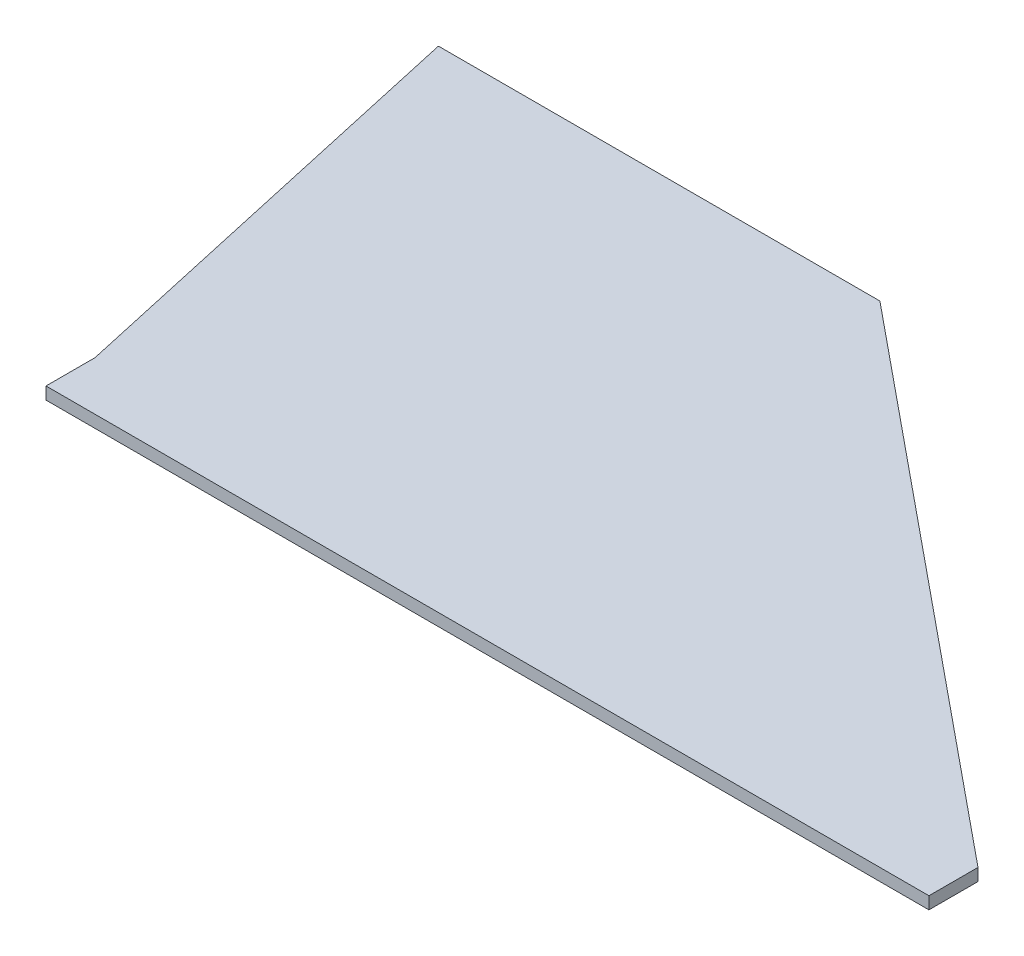
ISO-10303-21;
HEADER;
FILE_DESCRIPTION(('STEP AP214'),'2;1');
FILE_NAME('part.step','',(''),(''),'','','');
FILE_SCHEMA(('AUTOMOTIVE_DESIGN { 1 0 10303 214 1 1 1 1 }'));
ENDSEC;
DATA;
#1=APPLICATION_CONTEXT('core data for automotive mechanical design processes');
#2=APPLICATION_PROTOCOL_DEFINITION('international standard','automotive_design',2000,#1);
#3=PRODUCT_CONTEXT('',#1,'mechanical');
#4=PRODUCT('Part','Part','',(#3));
#5=PRODUCT_RELATED_PRODUCT_CATEGORY('part','',(#4));
#6=PRODUCT_DEFINITION_FORMATION('','',#4);
#7=PRODUCT_DEFINITION_CONTEXT('part definition',#1,'design');
#8=PRODUCT_DEFINITION('design','',#6,#7);
#9=PRODUCT_DEFINITION_SHAPE('','',#8);
#10=(LENGTH_UNIT() NAMED_UNIT(*) SI_UNIT(.MILLI.,.METRE.));
#11=(NAMED_UNIT(*) PLANE_ANGLE_UNIT() SI_UNIT($,.RADIAN.));
#12=(NAMED_UNIT(*) SI_UNIT($,.STERADIAN.) SOLID_ANGLE_UNIT());
#13=UNCERTAINTY_MEASURE_WITH_UNIT(LENGTH_MEASURE(1.E-05),#10,'distance_accuracy_value','');
#14=(GEOMETRIC_REPRESENTATION_CONTEXT(3) GLOBAL_UNCERTAINTY_ASSIGNED_CONTEXT((#13)) GLOBAL_UNIT_ASSIGNED_CONTEXT((#10,
#11,#12)) REPRESENTATION_CONTEXT('',''));
#15=CARTESIAN_POINT('',(0.,0.,0.));
#16=DIRECTION('',(0.,0.,1.));
#17=DIRECTION('',(1.,0.,0.));
#18=AXIS2_PLACEMENT_3D('',#15,#16,#17);
#19=CARTESIAN_POINT('',(0.,6.35,0.));
#20=DIRECTION('',(1.,0.,0.));
#21=DIRECTION('',(0.,0.,-1.));
#22=AXIS2_PLACEMENT_3D('',#19,#20,#21);
#23=PLANE('',#22);
#24=DIRECTION('',(0.,0.,1.));
#25=VECTOR('',#24,1.);
#26=CARTESIAN_POINT('',(0.,0.,0.));
#27=LINE('',#26,#25);
#28=CARTESIAN_POINT('',(0.,0.,-25.4));
#29=VERTEX_POINT('',#28);
#30=CARTESIAN_POINT('',(0.,0.,0.));
#31=VERTEX_POINT('',#30);
#32=EDGE_CURVE('E122',#29,#31,#27,.T.);
#33=ORIENTED_EDGE('',*,*,#32,.T.);
#34=DIRECTION('',(0.,-1.,0.));
#35=VECTOR('',#34,1.);
#36=CARTESIAN_POINT('',(0.,6.35,0.));
#37=LINE('',#36,#35);
#38=CARTESIAN_POINT('',(0.,6.35,0.));
#39=VERTEX_POINT('',#38);
#40=EDGE_CURVE('E11',#39,#31,#37,.T.);
#41=ORIENTED_EDGE('',*,*,#40,.F.);
#42=DIRECTION('',(0.,0.,1.));
#43=VECTOR('',#42,1.);
#44=CARTESIAN_POINT('',(0.,6.35,0.));
#45=LINE('',#44,#43);
#46=CARTESIAN_POINT('',(0.,6.35,-25.4));
#47=VERTEX_POINT('',#46);
#48=EDGE_CURVE('E132',#47,#39,#45,.T.);
#49=ORIENTED_EDGE('',*,*,#48,.F.);
#50=DIRECTION('',(0.,-1.,0.));
#51=VECTOR('',#50,1.);
#52=CARTESIAN_POINT('',(0.,6.35,-25.4));
#53=LINE('',#52,#51);
#54=EDGE_CURVE('E118',#47,#29,#53,.T.);
#55=ORIENTED_EDGE('',*,*,#54,.T.);
#56=EDGE_LOOP('',(#33,#41,#49,#55));
#57=FACE_BOUND('',#56,.T.);
#58=ADVANCED_FACE('F38',(#57),#23,.F.);
#59=CARTESIAN_POINT('',(0.,6.35,0.));
#60=DIRECTION('',(0.,0.,-1.));
#61=DIRECTION('',(-1.,0.,0.));
#62=AXIS2_PLACEMENT_3D('',#59,#60,#61);
#63=PLANE('',#62);
#64=DIRECTION('',(1.,0.,0.));
#65=VECTOR('',#64,1.);
#66=CARTESIAN_POINT('',(0.,0.,0.));
#67=LINE('',#66,#65);
#68=CARTESIAN_POINT('',(457.2,0.,0.));
#69=VERTEX_POINT('',#68);
#70=EDGE_CURVE('E125',#31,#69,#67,.T.);
#71=ORIENTED_EDGE('',*,*,#70,.T.);
#72=DIRECTION('',(0.,-1.,0.));
#73=VECTOR('',#72,1.);
#74=CARTESIAN_POINT('',(457.2,6.35,0.));
#75=LINE('',#74,#73);
#76=CARTESIAN_POINT('',(457.2,6.35,0.));
#77=VERTEX_POINT('',#76);
#78=EDGE_CURVE('E46',#77,#69,#75,.T.);
#79=ORIENTED_EDGE('',*,*,#78,.F.);
#80=DIRECTION('',(1.,0.,0.));
#81=VECTOR('',#80,1.);
#82=CARTESIAN_POINT('',(0.,6.35,0.));
#83=LINE('',#82,#81);
#84=EDGE_CURVE('E91',#39,#77,#83,.T.);
#85=ORIENTED_EDGE('',*,*,#84,.F.);
#86=ORIENTED_EDGE('',*,*,#40,.T.);
#87=EDGE_LOOP('',(#71,#79,#85,#86));
#88=FACE_BOUND('',#87,.T.);
#89=ADVANCED_FACE('F156',(#88),#63,.F.);
#90=CARTESIAN_POINT('',(457.2,6.35,0.));
#91=DIRECTION('',(-1.,0.,0.));
#92=DIRECTION('',(0.,0.,1.));
#93=AXIS2_PLACEMENT_3D('',#90,#91,#92);
#94=PLANE('',#93);
#95=DIRECTION('',(0.,0.,-1.));
#96=VECTOR('',#95,1.);
#97=CARTESIAN_POINT('',(457.2,0.,0.));
#98=LINE('',#97,#96);
#99=CARTESIAN_POINT('',(457.2,0.,-25.4));
#100=VERTEX_POINT('',#99);
#101=EDGE_CURVE('E127',#69,#100,#98,.T.);
#102=ORIENTED_EDGE('',*,*,#101,.T.);
#103=DIRECTION('',(0.,-1.,0.));
#104=VECTOR('',#103,1.);
#105=CARTESIAN_POINT('',(457.2,6.35,-25.4));
#106=LINE('',#105,#104);
#107=CARTESIAN_POINT('',(457.2,6.35,-25.4));
#108=VERTEX_POINT('',#107);
#109=EDGE_CURVE('E113',#108,#100,#106,.T.);
#110=ORIENTED_EDGE('',*,*,#109,.F.);
#111=DIRECTION('',(0.,0.,-1.));
#112=VECTOR('',#111,1.);
#113=CARTESIAN_POINT('',(457.2,6.35,0.));
#114=LINE('',#113,#112);
#115=EDGE_CURVE('E104',#77,#108,#114,.T.);
#116=ORIENTED_EDGE('',*,*,#115,.F.);
#117=ORIENTED_EDGE('',*,*,#78,.T.);
#118=EDGE_LOOP('',(#102,#110,#116,#117));
#119=FACE_BOUND('',#118,.T.);
#120=ADVANCED_FACE('F138',(#119),#94,.F.);
#121=CARTESIAN_POINT('',(177.8,6.35,-254.));
#122=DIRECTION('',(-0.633237790257263,0.,0.773957299203321));
#123=DIRECTION('',(0.773957299203321,0.,0.633237790257263));
#124=AXIS2_PLACEMENT_3D('',#121,#122,#123);
#125=PLANE('',#124);
#126=DIRECTION('',(-0.773957299203321,0.,-0.633237790257263));
#127=VECTOR('',#126,1.);
#128=CARTESIAN_POINT('',(177.8,0.,-254.));
#129=LINE('',#128,#127);
#130=CARTESIAN_POINT('',(177.8,0.,-254.));
#131=VERTEX_POINT('',#130);
#132=EDGE_CURVE('E112',#100,#131,#129,.T.);
#133=ORIENTED_EDGE('',*,*,#132,.T.);
#134=DIRECTION('',(0.,-1.,0.));
#135=VECTOR('',#134,1.);
#136=CARTESIAN_POINT('',(177.8,6.35,-254.));
#137=LINE('',#136,#135);
#138=CARTESIAN_POINT('',(177.8,6.35,-254.));
#139=VERTEX_POINT('',#138);
#140=EDGE_CURVE('E109',#139,#131,#137,.T.);
#141=ORIENTED_EDGE('',*,*,#140,.F.);
#142=DIRECTION('',(-0.773957299203321,0.,-0.633237790257263));
#143=VECTOR('',#142,1.);
#144=CARTESIAN_POINT('',(177.8,6.35,-254.));
#145=LINE('',#144,#143);
#146=EDGE_CURVE('E98',#108,#139,#145,.T.);
#147=ORIENTED_EDGE('',*,*,#146,.F.);
#148=ORIENTED_EDGE('',*,*,#109,.T.);
#149=EDGE_LOOP('',(#133,#141,#147,#148));
#150=FACE_BOUND('',#149,.T.);
#151=ADVANCED_FACE('F110',(#150),#125,.F.);
#152=CARTESIAN_POINT('',(-50.8,6.35,-254.));
#153=DIRECTION('',(0.,0.,1.));
#154=DIRECTION('',(1.,0.,0.));
#155=AXIS2_PLACEMENT_3D('',#152,#153,#154);
#156=PLANE('',#155);
#157=DIRECTION('',(-1.,0.,0.));
#158=VECTOR('',#157,1.);
#159=CARTESIAN_POINT('',(-50.8,0.,-254.));
#160=LINE('',#159,#158);
#161=CARTESIAN_POINT('',(-50.8,0.,-254.));
#162=VERTEX_POINT('',#161);
#163=EDGE_CURVE('E77',#131,#162,#160,.T.);
#164=ORIENTED_EDGE('',*,*,#163,.T.);
#165=DIRECTION('',(0.,-1.,0.));
#166=VECTOR('',#165,1.);
#167=CARTESIAN_POINT('',(-50.8,6.35,-254.));
#168=LINE('',#167,#166);
#169=CARTESIAN_POINT('',(-50.8,6.35,-254.));
#170=VERTEX_POINT('',#169);
#171=EDGE_CURVE('E114',#170,#162,#168,.T.);
#172=ORIENTED_EDGE('',*,*,#171,.F.);
#173=DIRECTION('',(-1.,0.,0.));
#174=VECTOR('',#173,1.);
#175=CARTESIAN_POINT('',(-50.8,6.35,-254.));
#176=LINE('',#175,#174);
#177=EDGE_CURVE('E102',#139,#170,#176,.T.);
#178=ORIENTED_EDGE('',*,*,#177,.F.);
#179=ORIENTED_EDGE('',*,*,#140,.T.);
#180=EDGE_LOOP('',(#164,#172,#178,#179));
#181=FACE_BOUND('',#180,.T.);
#182=ADVANCED_FACE('F116',(#181),#156,.F.);
#183=CARTESIAN_POINT('',(0.,6.35,-25.4));
#184=DIRECTION('',(0.976187060183953,0.,-0.216930457818656));
#185=DIRECTION('',(-0.216930457818656,0.,-0.976187060183953));
#186=AXIS2_PLACEMENT_3D('',#183,#184,#185);
#187=PLANE('',#186);
#188=DIRECTION('',(0.216930457818656,0.,0.976187060183953));
#189=VECTOR('',#188,1.);
#190=CARTESIAN_POINT('',(0.,0.,-25.4));
#191=LINE('',#190,#189);
#192=EDGE_CURVE('E83',#162,#29,#191,.T.);
#193=ORIENTED_EDGE('',*,*,#192,.T.);
#194=ORIENTED_EDGE('',*,*,#54,.F.);
#195=DIRECTION('',(0.216930457818656,0.,0.976187060183953));
#196=VECTOR('',#195,1.);
#197=CARTESIAN_POINT('',(0.,6.35,-25.4));
#198=LINE('',#197,#196);
#199=EDGE_CURVE('E54',#170,#47,#198,.T.);
#200=ORIENTED_EDGE('',*,*,#199,.F.);
#201=ORIENTED_EDGE('',*,*,#171,.T.);
#202=EDGE_LOOP('',(#193,#194,#200,#201));
#203=FACE_BOUND('',#202,.T.);
#204=ADVANCED_FACE('F145',(#203),#187,.F.);
#205=CARTESIAN_POINT('',(0.,6.35,0.));
#206=DIRECTION('',(0.,-1.,0.));
#207=DIRECTION('',(0.,0.,-1.));
#208=AXIS2_PLACEMENT_3D('',#205,#206,#207);
#209=PLANE('',#208);
#210=ORIENTED_EDGE('',*,*,#48,.T.);
#211=ORIENTED_EDGE('',*,*,#84,.T.);
#212=ORIENTED_EDGE('',*,*,#115,.T.);
#213=ORIENTED_EDGE('',*,*,#146,.T.);
#214=ORIENTED_EDGE('',*,*,#177,.T.);
#215=ORIENTED_EDGE('',*,*,#199,.T.);
#216=EDGE_LOOP('',(#210,#211,#212,#213,#214,#215));
#217=FACE_BOUND('',#216,.T.);
#218=ADVANCED_FACE('F100',(#217),#209,.F.);
#219=CARTESIAN_POINT('',(0.,0.,0.));
#220=DIRECTION('',(0.,-1.,0.));
#221=DIRECTION('',(0.,0.,-1.));
#222=AXIS2_PLACEMENT_3D('',#219,#220,#221);
#223=PLANE('',#222);
#224=ORIENTED_EDGE('',*,*,#32,.F.);
#225=ORIENTED_EDGE('',*,*,#192,.F.);
#226=ORIENTED_EDGE('',*,*,#163,.F.);
#227=ORIENTED_EDGE('',*,*,#132,.F.);
#228=ORIENTED_EDGE('',*,*,#101,.F.);
#229=ORIENTED_EDGE('',*,*,#70,.F.);
#230=EDGE_LOOP('',(#224,#225,#226,#227,#228,#229));
#231=FACE_BOUND('',#230,.T.);
#232=ADVANCED_FACE('F141',(#231),#223,.T.);
#233=CLOSED_SHELL('',(#58,#89,#120,#151,#182,#204,#218,#232));
#234=MANIFOLD_SOLID_BREP('B2',#233);
#235=ADVANCED_BREP_SHAPE_REPRESENTATION('',(#18,#234),#14);
#236=SHAPE_DEFINITION_REPRESENTATION(#9,#235);
ENDSEC;
END-ISO-10303-21;
